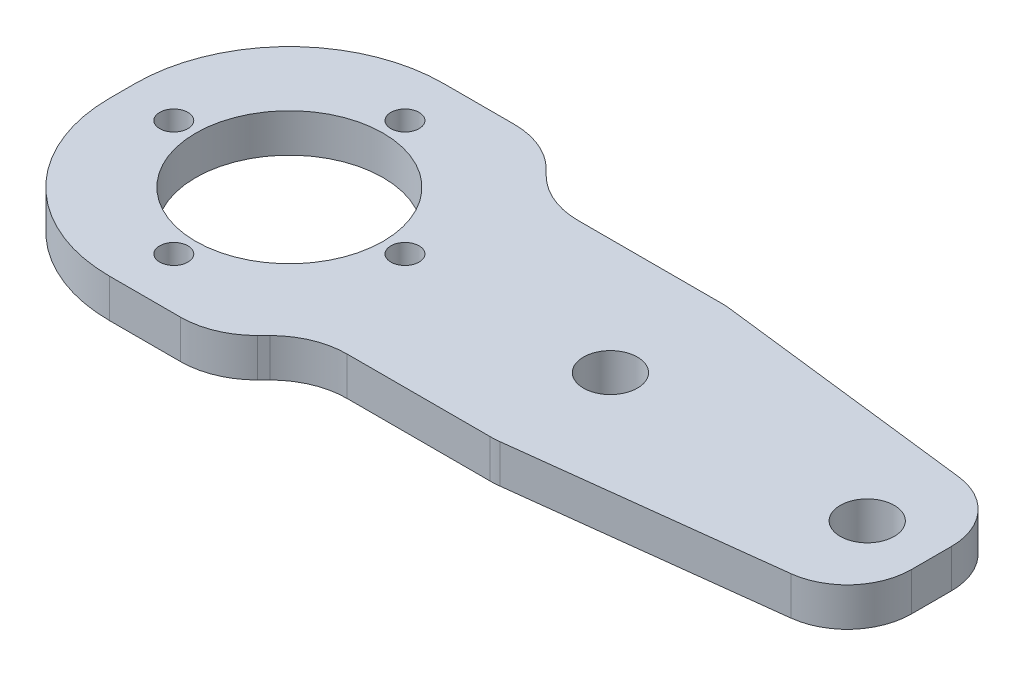
ISO-10303-21;
HEADER;
FILE_DESCRIPTION(('STEP AP214'),'2;1');
FILE_NAME('part.step','',(''),(''),'','','');
FILE_SCHEMA(('AUTOMOTIVE_DESIGN { 1 0 10303 214 1 1 1 1 }'));
ENDSEC;
DATA;
#1=APPLICATION_CONTEXT('core data for automotive mechanical design processes');
#2=APPLICATION_PROTOCOL_DEFINITION('international standard','automotive_design',2000,#1);
#3=PRODUCT_CONTEXT('',#1,'mechanical');
#4=PRODUCT('Part','Part','',(#3));
#5=PRODUCT_RELATED_PRODUCT_CATEGORY('part','',(#4));
#6=PRODUCT_DEFINITION_FORMATION('','',#4);
#7=PRODUCT_DEFINITION_CONTEXT('part definition',#1,'design');
#8=PRODUCT_DEFINITION('design','',#6,#7);
#9=PRODUCT_DEFINITION_SHAPE('','',#8);
#10=(LENGTH_UNIT() NAMED_UNIT(*) SI_UNIT(.MILLI.,.METRE.));
#11=(NAMED_UNIT(*) PLANE_ANGLE_UNIT() SI_UNIT($,.RADIAN.));
#12=(NAMED_UNIT(*) SI_UNIT($,.STERADIAN.) SOLID_ANGLE_UNIT());
#13=UNCERTAINTY_MEASURE_WITH_UNIT(LENGTH_MEASURE(1.E-05),#10,'distance_accuracy_value','');
#14=(GEOMETRIC_REPRESENTATION_CONTEXT(3) GLOBAL_UNCERTAINTY_ASSIGNED_CONTEXT((#13)) GLOBAL_UNIT_ASSIGNED_CONTEXT((#10,
#11,#12)) REPRESENTATION_CONTEXT('',''));
#15=CARTESIAN_POINT('',(0.,0.,0.));
#16=DIRECTION('',(0.,0.,1.));
#17=DIRECTION('',(1.,0.,0.));
#18=AXIS2_PLACEMENT_3D('',#15,#16,#17);
#19=CARTESIAN_POINT('',(0.,3.,0.));
#20=DIRECTION('',(0.,-1.,0.));
#21=DIRECTION('',(0.,0.,-1.));
#22=AXIS2_PLACEMENT_3D('',#19,#20,#21);
#23=PLANE('',#22);
#24=CARTESIAN_POINT('',(22.,3.,-13.));
#25=DIRECTION('',(0.,1.,0.));
#26=DIRECTION('',(0.,0.,1.));
#27=AXIS2_PLACEMENT_3D('',#24,#25,#26);
#28=CIRCLE('',#27,1.1);
#29=CARTESIAN_POINT('',(22.,3.,-11.9));
#30=VERTEX_POINT('',#29);
#31=EDGE_CURVE('E297',#30,#30,#28,.T.);
#32=ORIENTED_EDGE('',*,*,#31,.F.);
#33=EDGE_LOOP('',(#32));
#34=FACE_BOUND('',#33,.T.);
#35=CARTESIAN_POINT('',(13.,3.,-4.));
#36=DIRECTION('',(0.,1.,0.));
#37=DIRECTION('',(0.,0.,1.));
#38=AXIS2_PLACEMENT_3D('',#35,#36,#37);
#39=CIRCLE('',#38,1.1);
#40=CARTESIAN_POINT('',(13.,3.,-2.9));
#41=VERTEX_POINT('',#40);
#42=EDGE_CURVE('E756',#41,#41,#39,.T.);
#43=ORIENTED_EDGE('',*,*,#42,.F.);
#44=EDGE_LOOP('',(#43));
#45=FACE_BOUND('',#44,.T.);
#46=CARTESIAN_POINT('',(4.,3.,-13.0000000000001));
#47=DIRECTION('',(0.,1.,0.));
#48=DIRECTION('',(0.,0.,1.));
#49=AXIS2_PLACEMENT_3D('',#46,#47,#48);
#50=CIRCLE('',#49,1.1);
#51=CARTESIAN_POINT('',(4.,3.,-11.9000000000001));
#52=VERTEX_POINT('',#51);
#53=EDGE_CURVE('E759',#52,#52,#50,.T.);
#54=ORIENTED_EDGE('',*,*,#53,.F.);
#55=EDGE_LOOP('',(#54));
#56=FACE_BOUND('',#55,.T.);
#57=CARTESIAN_POINT('',(13.0000000000001,3.,-22.));
#58=DIRECTION('',(0.,1.,0.));
#59=DIRECTION('',(0.,0.,1.));
#60=AXIS2_PLACEMENT_3D('',#57,#58,#59);
#61=CIRCLE('',#60,1.1);
#62=CARTESIAN_POINT('',(13.0000000000001,3.,-20.9));
#63=VERTEX_POINT('',#62);
#64=EDGE_CURVE('E763',#63,#63,#61,.T.);
#65=ORIENTED_EDGE('',*,*,#64,.F.);
#66=EDGE_LOOP('',(#65));
#67=FACE_BOUND('',#66,.T.);
#68=DIRECTION('',(0.992876838486922,0.,-0.119145220618431));
#69=VECTOR('',#68,1.);
#70=CARTESIAN_POINT('',(38.,3.,-4.));
#71=LINE('',#70,#69);
#72=CARTESIAN_POINT('',(38.3561580756539,3.,-4.04273896907847));
#73=VERTEX_POINT('',#72);
#74=CARTESIAN_POINT('',(58.5957261030921,3.,-6.47148713237106));
#75=VERTEX_POINT('',#74);
#76=EDGE_CURVE('E334',#73,#75,#71,.T.);
#77=ORIENTED_EDGE('',*,*,#76,.T.);
#78=CARTESIAN_POINT('',(58.,3.,-11.4358713248057));
#79=DIRECTION('',(0.,-1.,0.));
#80=DIRECTION('',(0.,0.,-1.));
#81=AXIS2_PLACEMENT_3D('',#78,#79,#80);
#82=CIRCLE('',#81,5.);
#83=CARTESIAN_POINT('',(63.,3.,-11.4358713248057));
#84=VERTEX_POINT('',#83);
#85=EDGE_CURVE('E45',#75,#84,#82,.F.);
#86=ORIENTED_EDGE('',*,*,#85,.T.);
#87=DIRECTION('',(0.,0.,-1.));
#88=VECTOR('',#87,1.);
#89=CARTESIAN_POINT('',(63.,3.,-19.));
#90=LINE('',#89,#88);
#91=CARTESIAN_POINT('',(63.,3.,-14.5641286751943));
#92=VERTEX_POINT('',#91);
#93=EDGE_CURVE('E336',#84,#92,#90,.T.);
#94=ORIENTED_EDGE('',*,*,#93,.T.);
#95=CARTESIAN_POINT('',(58.,3.,-14.5641286751943));
#96=DIRECTION('',(0.,-1.,0.));
#97=DIRECTION('',(0.,0.,-1.));
#98=AXIS2_PLACEMENT_3D('',#95,#96,#97);
#99=CIRCLE('',#98,5.);
#100=CARTESIAN_POINT('',(58.5957261030922,3.,-19.5285128676289));
#101=VERTEX_POINT('',#100);
#102=EDGE_CURVE('E53',#92,#101,#99,.F.);
#103=ORIENTED_EDGE('',*,*,#102,.T.);
#104=DIRECTION('',(-0.992876838486922,0.,-0.11914522061843));
#105=VECTOR('',#104,1.);
#106=CARTESIAN_POINT('',(38.,3.,-22.));
#107=LINE('',#106,#105);
#108=CARTESIAN_POINT('',(38.3561580756539,3.,-21.9572610309215));
#109=VERTEX_POINT('',#108);
#110=EDGE_CURVE('E338',#101,#109,#107,.T.);
#111=ORIENTED_EDGE('',*,*,#110,.T.);
#112=CARTESIAN_POINT('',(37.6412867519433,3.,-16.));
#113=DIRECTION('',(0.,-1.,0.));
#114=DIRECTION('',(0.,0.,-1.));
#115=AXIS2_PLACEMENT_3D('',#112,#113,#114);
#116=CIRCLE('',#115,6.);
#117=CARTESIAN_POINT('',(37.6412867519433,3.,-22.));
#118=VERTEX_POINT('',#117);
#119=EDGE_CURVE('E248',#109,#118,#116,.F.);
#120=ORIENTED_EDGE('',*,*,#119,.T.);
#121=DIRECTION('',(-1.,0.,0.));
#122=VECTOR('',#121,1.);
#123=CARTESIAN_POINT('',(24.,3.,-22.));
#124=LINE('',#123,#122);
#125=CARTESIAN_POINT('',(26.4852813742386,3.,-22.));
#126=VERTEX_POINT('',#125);
#127=EDGE_CURVE('E340',#118,#126,#124,.T.);
#128=ORIENTED_EDGE('',*,*,#127,.T.);
#129=CARTESIAN_POINT('',(26.4852813742386,3.,-28.));
#130=DIRECTION('',(0.,-1.,0.));
#131=DIRECTION('',(0.,0.,-1.));
#132=AXIS2_PLACEMENT_3D('',#129,#130,#131);
#133=CIRCLE('',#132,6.);
#134=CARTESIAN_POINT('',(22.2426406871193,3.,-23.7573593128807));
#135=VERTEX_POINT('',#134);
#136=EDGE_CURVE('E279',#126,#135,#133,.T.);
#137=ORIENTED_EDGE('',*,*,#136,.T.);
#138=DIRECTION('',(-0.707106781186548,0.,-0.707106781186548));
#139=VECTOR('',#138,1.);
#140=CARTESIAN_POINT('',(20.,3.,-26.));
#141=LINE('',#140,#139);
#142=CARTESIAN_POINT('',(21.7573593128807,3.,-24.2426406871193));
#143=VERTEX_POINT('',#142);
#144=EDGE_CURVE('E343',#135,#143,#141,.T.);
#145=ORIENTED_EDGE('',*,*,#144,.T.);
#146=CARTESIAN_POINT('',(17.5147186257614,3.,-20.));
#147=DIRECTION('',(0.,-1.,0.));
#148=DIRECTION('',(0.,0.,-1.));
#149=AXIS2_PLACEMENT_3D('',#146,#147,#148);
#150=CIRCLE('',#149,6.);
#151=CARTESIAN_POINT('',(17.5147186257614,3.,-26.));
#152=VERTEX_POINT('',#151);
#153=EDGE_CURVE('E244',#143,#152,#150,.F.);
#154=ORIENTED_EDGE('',*,*,#153,.T.);
#155=DIRECTION('',(-1.,0.,0.));
#156=VECTOR('',#155,1.);
#157=CARTESIAN_POINT('',(0.,3.,-26.));
#158=LINE('',#157,#156);
#159=CARTESIAN_POINT('',(12.,3.,-26.));
#160=VERTEX_POINT('',#159);
#161=EDGE_CURVE('E346',#152,#160,#158,.T.);
#162=ORIENTED_EDGE('',*,*,#161,.T.);
#163=CARTESIAN_POINT('',(12.,3.,-14.));
#164=DIRECTION('',(0.,-1.,0.));
#165=DIRECTION('',(0.,0.,-1.));
#166=AXIS2_PLACEMENT_3D('',#163,#164,#165);
#167=CIRCLE('',#166,12.);
#168=CARTESIAN_POINT('',(0.,3.,-14.));
#169=VERTEX_POINT('',#168);
#170=EDGE_CURVE('E220',#160,#169,#167,.F.);
#171=ORIENTED_EDGE('',*,*,#170,.T.);
#172=DIRECTION('',(0.,0.,1.));
#173=VECTOR('',#172,1.);
#174=CARTESIAN_POINT('',(0.,3.,0.));
#175=LINE('',#174,#173);
#176=CARTESIAN_POINT('',(0.,3.,-12.));
#177=VERTEX_POINT('',#176);
#178=EDGE_CURVE('E198',#169,#177,#175,.T.);
#179=ORIENTED_EDGE('',*,*,#178,.T.);
#180=CARTESIAN_POINT('',(12.,3.,-12.));
#181=DIRECTION('',(0.,-1.,0.));
#182=DIRECTION('',(0.,0.,-1.));
#183=AXIS2_PLACEMENT_3D('',#180,#181,#182);
#184=CIRCLE('',#183,12.);
#185=CARTESIAN_POINT('',(12.,3.,0.));
#186=VERTEX_POINT('',#185);
#187=EDGE_CURVE('E218',#177,#186,#184,.F.);
#188=ORIENTED_EDGE('',*,*,#187,.T.);
#189=DIRECTION('',(1.,0.,0.));
#190=VECTOR('',#189,1.);
#191=CARTESIAN_POINT('',(0.,3.,0.));
#192=LINE('',#191,#190);
#193=CARTESIAN_POINT('',(17.5147186257614,3.,0.));
#194=VERTEX_POINT('',#193);
#195=EDGE_CURVE('E205',#186,#194,#192,.T.);
#196=ORIENTED_EDGE('',*,*,#195,.T.);
#197=CARTESIAN_POINT('',(17.5147186257614,3.,-6.));
#198=DIRECTION('',(0.,-1.,0.));
#199=DIRECTION('',(0.,0.,-1.));
#200=AXIS2_PLACEMENT_3D('',#197,#198,#199);
#201=CIRCLE('',#200,6.);
#202=CARTESIAN_POINT('',(21.7573593128807,3.,-1.75735931288072));
#203=VERTEX_POINT('',#202);
#204=EDGE_CURVE('E242',#194,#203,#201,.F.);
#205=ORIENTED_EDGE('',*,*,#204,.T.);
#206=DIRECTION('',(0.707106781186548,0.,-0.707106781186548));
#207=VECTOR('',#206,1.);
#208=CARTESIAN_POINT('',(20.,3.,0.));
#209=LINE('',#208,#207);
#210=CARTESIAN_POINT('',(22.2426406871193,3.,-2.24264068711929));
#211=VERTEX_POINT('',#210);
#212=EDGE_CURVE('E209',#203,#211,#209,.T.);
#213=ORIENTED_EDGE('',*,*,#212,.T.);
#214=CARTESIAN_POINT('',(26.4852813742386,3.,2.));
#215=DIRECTION('',(0.,-1.,0.));
#216=DIRECTION('',(0.,0.,-1.));
#217=AXIS2_PLACEMENT_3D('',#214,#215,#216);
#218=CIRCLE('',#217,6.);
#219=CARTESIAN_POINT('',(26.4852813742386,3.,-4.));
#220=VERTEX_POINT('',#219);
#221=EDGE_CURVE('E275',#211,#220,#218,.T.);
#222=ORIENTED_EDGE('',*,*,#221,.T.);
#223=DIRECTION('',(1.,0.,0.));
#224=VECTOR('',#223,1.);
#225=CARTESIAN_POINT('',(24.,3.,-4.));
#226=LINE('',#225,#224);
#227=CARTESIAN_POINT('',(37.6412867519433,3.,-4.));
#228=VERTEX_POINT('',#227);
#229=EDGE_CURVE('E331',#220,#228,#226,.T.);
#230=ORIENTED_EDGE('',*,*,#229,.T.);
#231=CARTESIAN_POINT('',(37.6412867519433,3.,-10.));
#232=DIRECTION('',(0.,-1.,0.));
#233=DIRECTION('',(0.,0.,-1.));
#234=AXIS2_PLACEMENT_3D('',#231,#232,#233);
#235=CIRCLE('',#234,6.);
#236=EDGE_CURVE('E246',#228,#73,#235,.F.);
#237=ORIENTED_EDGE('',*,*,#236,.T.);
#238=EDGE_LOOP('',(#77,#86,#94,#103,#111,#120,#128,#137,#145,#154,#162,#171,#179,#188,#196,#205,
#213,#222,#230,#237));
#239=FACE_BOUND('',#238,.T.);
#240=CARTESIAN_POINT('',(13.,3.,-13.));
#241=DIRECTION('',(0.,1.,0.));
#242=DIRECTION('',(0.,0.,1.));
#243=AXIS2_PLACEMENT_3D('',#240,#241,#242);
#244=CIRCLE('',#243,7.3);
#245=CARTESIAN_POINT('',(13.,3.,-5.7));
#246=VERTEX_POINT('',#245);
#247=EDGE_CURVE('E323',#246,#246,#244,.T.);
#248=ORIENTED_EDGE('',*,*,#247,.F.);
#249=EDGE_LOOP('',(#248));
#250=FACE_BOUND('',#249,.T.);
#251=CARTESIAN_POINT('',(38.,3.,-13.));
#252=DIRECTION('',(0.,1.,0.));
#253=DIRECTION('',(0.,0.,1.));
#254=AXIS2_PLACEMENT_3D('',#251,#252,#253);
#255=CIRCLE('',#254,2.1);
#256=CARTESIAN_POINT('',(38.,3.,-10.9));
#257=VERTEX_POINT('',#256);
#258=EDGE_CURVE('E317',#257,#257,#255,.T.);
#259=ORIENTED_EDGE('',*,*,#258,.F.);
#260=EDGE_LOOP('',(#259));
#261=FACE_BOUND('',#260,.T.);
#262=CARTESIAN_POINT('',(58.,3.,-13.));
#263=DIRECTION('',(0.,1.,0.));
#264=DIRECTION('',(0.,0.,1.));
#265=AXIS2_PLACEMENT_3D('',#262,#263,#264);
#266=CIRCLE('',#265,2.1);
#267=CARTESIAN_POINT('',(58.,3.,-10.9));
#268=VERTEX_POINT('',#267);
#269=EDGE_CURVE('E308',#268,#268,#266,.T.);
#270=ORIENTED_EDGE('',*,*,#269,.F.);
#271=EDGE_LOOP('',(#270));
#272=FACE_BOUND('',#271,.T.);
#273=ADVANCED_FACE('F36',(#34,#45,#56,#67,#239,#250,#261,#272),#23,.F.);
#274=CARTESIAN_POINT('',(0.,0.,0.));
#275=DIRECTION('',(0.,-1.,0.));
#276=DIRECTION('',(0.,0.,-1.));
#277=AXIS2_PLACEMENT_3D('',#274,#275,#276);
#278=PLANE('',#277);
#279=CARTESIAN_POINT('',(22.,0.,-13.));
#280=DIRECTION('',(0.,-1.,0.));
#281=DIRECTION('',(0.,0.,-1.));
#282=AXIS2_PLACEMENT_3D('',#279,#280,#281);
#283=CIRCLE('',#282,1.1);
#284=CARTESIAN_POINT('',(22.,0.,-14.1));
#285=VERTEX_POINT('',#284);
#286=EDGE_CURVE('E40',#285,#285,#283,.T.);
#287=ORIENTED_EDGE('',*,*,#286,.F.);
#288=EDGE_LOOP('',(#287));
#289=FACE_BOUND('',#288,.T.);
#290=CARTESIAN_POINT('',(13.,0.,-4.));
#291=DIRECTION('',(0.,-1.,0.));
#292=DIRECTION('',(0.,0.,-1.));
#293=AXIS2_PLACEMENT_3D('',#290,#291,#292);
#294=CIRCLE('',#293,1.1);
#295=CARTESIAN_POINT('',(13.,0.,-5.1));
#296=VERTEX_POINT('',#295);
#297=EDGE_CURVE('E299',#296,#296,#294,.T.);
#298=ORIENTED_EDGE('',*,*,#297,.F.);
#299=EDGE_LOOP('',(#298));
#300=FACE_BOUND('',#299,.T.);
#301=CARTESIAN_POINT('',(4.,0.,-13.0000000000001));
#302=DIRECTION('',(0.,-1.,0.));
#303=DIRECTION('',(0.,0.,-1.));
#304=AXIS2_PLACEMENT_3D('',#301,#302,#303);
#305=CIRCLE('',#304,1.1);
#306=CARTESIAN_POINT('',(4.,0.,-14.1000000000001));
#307=VERTEX_POINT('',#306);
#308=EDGE_CURVE('E296',#307,#307,#305,.T.);
#309=ORIENTED_EDGE('',*,*,#308,.F.);
#310=EDGE_LOOP('',(#309));
#311=FACE_BOUND('',#310,.T.);
#312=CARTESIAN_POINT('',(13.0000000000001,0.,-22.));
#313=DIRECTION('',(0.,-1.,0.));
#314=DIRECTION('',(0.,0.,-1.));
#315=AXIS2_PLACEMENT_3D('',#312,#313,#314);
#316=CIRCLE('',#315,1.1);
#317=CARTESIAN_POINT('',(13.0000000000001,0.,-23.1));
#318=VERTEX_POINT('',#317);
#319=EDGE_CURVE('E293',#318,#318,#316,.T.);
#320=ORIENTED_EDGE('',*,*,#319,.F.);
#321=EDGE_LOOP('',(#320));
#322=FACE_BOUND('',#321,.T.);
#323=CARTESIAN_POINT('',(38.,0.,-13.));
#324=DIRECTION('',(0.,1.,0.));
#325=DIRECTION('',(0.,0.,1.));
#326=AXIS2_PLACEMENT_3D('',#323,#324,#325);
#327=CIRCLE('',#326,2.1);
#328=CARTESIAN_POINT('',(38.,0.,-10.9));
#329=VERTEX_POINT('',#328);
#330=EDGE_CURVE('E313',#329,#329,#327,.T.);
#331=ORIENTED_EDGE('',*,*,#330,.T.);
#332=EDGE_LOOP('',(#331));
#333=FACE_BOUND('',#332,.T.);
#334=DIRECTION('',(0.,0.,-1.));
#335=VECTOR('',#334,1.);
#336=CARTESIAN_POINT('',(63.,0.,-19.));
#337=LINE('',#336,#335);
#338=CARTESIAN_POINT('',(63.,0.,-11.4358713248057));
#339=VERTEX_POINT('',#338);
#340=CARTESIAN_POINT('',(63.,0.,-14.5641286751943));
#341=VERTEX_POINT('',#340);
#342=EDGE_CURVE('E359',#339,#341,#337,.T.);
#343=ORIENTED_EDGE('',*,*,#342,.F.);
#344=CARTESIAN_POINT('',(58.,0.,-11.4358713248057));
#345=DIRECTION('',(0.,-1.,0.));
#346=DIRECTION('',(0.,0.,-1.));
#347=AXIS2_PLACEMENT_3D('',#344,#345,#346);
#348=CIRCLE('',#347,5.);
#349=CARTESIAN_POINT('',(58.5957261030921,0.,-6.47148713237106));
#350=VERTEX_POINT('',#349);
#351=EDGE_CURVE('E288',#339,#350,#348,.T.);
#352=ORIENTED_EDGE('',*,*,#351,.T.);
#353=DIRECTION('',(0.992876838486922,0.,-0.119145220618431));
#354=VECTOR('',#353,1.);
#355=CARTESIAN_POINT('',(38.,0.,-4.));
#356=LINE('',#355,#354);
#357=CARTESIAN_POINT('',(38.3561580756539,0.,-4.04273896907847));
#358=VERTEX_POINT('',#357);
#359=EDGE_CURVE('E357',#358,#350,#356,.T.);
#360=ORIENTED_EDGE('',*,*,#359,.F.);
#361=CARTESIAN_POINT('',(37.6412867519433,0.,-10.));
#362=DIRECTION('',(0.,-1.,0.));
#363=DIRECTION('',(0.,0.,-1.));
#364=AXIS2_PLACEMENT_3D('',#361,#362,#363);
#365=CIRCLE('',#364,6.);
#366=CARTESIAN_POINT('',(37.6412867519433,0.,-4.));
#367=VERTEX_POINT('',#366);
#368=EDGE_CURVE('E234',#358,#367,#365,.T.);
#369=ORIENTED_EDGE('',*,*,#368,.T.);
#370=DIRECTION('',(1.,0.,0.));
#371=VECTOR('',#370,1.);
#372=CARTESIAN_POINT('',(24.,0.,-4.));
#373=LINE('',#372,#371);
#374=CARTESIAN_POINT('',(26.4852813742386,0.,-4.));
#375=VERTEX_POINT('',#374);
#376=EDGE_CURVE('E354',#375,#367,#373,.T.);
#377=ORIENTED_EDGE('',*,*,#376,.F.);
#378=CARTESIAN_POINT('',(26.4852813742386,0.,2.));
#379=DIRECTION('',(0.,-1.,0.));
#380=DIRECTION('',(0.,0.,-1.));
#381=AXIS2_PLACEMENT_3D('',#378,#379,#380);
#382=CIRCLE('',#381,6.);
#383=CARTESIAN_POINT('',(22.2426406871193,0.,-2.24264068711929));
#384=VERTEX_POINT('',#383);
#385=EDGE_CURVE('E273',#375,#384,#382,.F.);
#386=ORIENTED_EDGE('',*,*,#385,.T.);
#387=DIRECTION('',(0.707106781186548,0.,-0.707106781186548));
#388=VECTOR('',#387,1.);
#389=CARTESIAN_POINT('',(20.,0.,0.));
#390=LINE('',#389,#388);
#391=CARTESIAN_POINT('',(21.7573593128807,0.,-1.75735931288072));
#392=VERTEX_POINT('',#391);
#393=EDGE_CURVE('E351',#392,#384,#390,.T.);
#394=ORIENTED_EDGE('',*,*,#393,.F.);
#395=CARTESIAN_POINT('',(17.5147186257614,0.,-6.));
#396=DIRECTION('',(0.,-1.,0.));
#397=DIRECTION('',(0.,0.,-1.));
#398=AXIS2_PLACEMENT_3D('',#395,#396,#397);
#399=CIRCLE('',#398,6.);
#400=CARTESIAN_POINT('',(17.5147186257614,0.,0.));
#401=VERTEX_POINT('',#400);
#402=EDGE_CURVE('E230',#392,#401,#399,.T.);
#403=ORIENTED_EDGE('',*,*,#402,.T.);
#404=DIRECTION('',(1.,0.,0.));
#405=VECTOR('',#404,1.);
#406=CARTESIAN_POINT('',(0.,0.,0.));
#407=LINE('',#406,#405);
#408=CARTESIAN_POINT('',(12.,0.,0.));
#409=VERTEX_POINT('',#408);
#410=EDGE_CURVE('E326',#409,#401,#407,.T.);
#411=ORIENTED_EDGE('',*,*,#410,.F.);
#412=CARTESIAN_POINT('',(12.,0.,-12.));
#413=DIRECTION('',(0.,-1.,0.));
#414=DIRECTION('',(0.,0.,-1.));
#415=AXIS2_PLACEMENT_3D('',#412,#413,#414);
#416=CIRCLE('',#415,12.);
#417=CARTESIAN_POINT('',(0.,0.,-12.));
#418=VERTEX_POINT('',#417);
#419=EDGE_CURVE('E189',#409,#418,#416,.T.);
#420=ORIENTED_EDGE('',*,*,#419,.T.);
#421=DIRECTION('',(0.,0.,1.));
#422=VECTOR('',#421,1.);
#423=CARTESIAN_POINT('',(0.,0.,0.));
#424=LINE('',#423,#422);
#425=CARTESIAN_POINT('',(0.,0.,-14.));
#426=VERTEX_POINT('',#425);
#427=EDGE_CURVE('E195',#426,#418,#424,.T.);
#428=ORIENTED_EDGE('',*,*,#427,.F.);
#429=CARTESIAN_POINT('',(12.,0.,-14.));
#430=DIRECTION('',(0.,-1.,0.));
#431=DIRECTION('',(0.,0.,-1.));
#432=AXIS2_PLACEMENT_3D('',#429,#430,#431);
#433=CIRCLE('',#432,12.);
#434=CARTESIAN_POINT('',(12.,0.,-26.));
#435=VERTEX_POINT('',#434);
#436=EDGE_CURVE('E179',#426,#435,#433,.T.);
#437=ORIENTED_EDGE('',*,*,#436,.T.);
#438=DIRECTION('',(-1.,0.,0.));
#439=VECTOR('',#438,1.);
#440=CARTESIAN_POINT('',(0.,0.,-26.));
#441=LINE('',#440,#439);
#442=CARTESIAN_POINT('',(17.5147186257614,0.,-26.));
#443=VERTEX_POINT('',#442);
#444=EDGE_CURVE('E206',#443,#435,#441,.T.);
#445=ORIENTED_EDGE('',*,*,#444,.F.);
#446=CARTESIAN_POINT('',(17.5147186257614,0.,-20.));
#447=DIRECTION('',(0.,-1.,0.));
#448=DIRECTION('',(0.,0.,-1.));
#449=AXIS2_PLACEMENT_3D('',#446,#447,#448);
#450=CIRCLE('',#449,6.);
#451=CARTESIAN_POINT('',(21.7573593128807,0.,-24.2426406871193));
#452=VERTEX_POINT('',#451);
#453=EDGE_CURVE('E232',#443,#452,#450,.T.);
#454=ORIENTED_EDGE('',*,*,#453,.T.);
#455=DIRECTION('',(-0.707106781186548,0.,-0.707106781186548));
#456=VECTOR('',#455,1.);
#457=CARTESIAN_POINT('',(20.,0.,-26.));
#458=LINE('',#457,#456);
#459=CARTESIAN_POINT('',(22.2426406871193,0.,-23.7573593128807));
#460=VERTEX_POINT('',#459);
#461=EDGE_CURVE('E211',#460,#452,#458,.T.);
#462=ORIENTED_EDGE('',*,*,#461,.F.);
#463=CARTESIAN_POINT('',(26.4852813742386,0.,-28.));
#464=DIRECTION('',(0.,-1.,0.));
#465=DIRECTION('',(0.,0.,-1.));
#466=AXIS2_PLACEMENT_3D('',#463,#464,#465);
#467=CIRCLE('',#466,6.);
#468=CARTESIAN_POINT('',(26.4852813742386,0.,-22.));
#469=VERTEX_POINT('',#468);
#470=EDGE_CURVE('E277',#460,#469,#467,.F.);
#471=ORIENTED_EDGE('',*,*,#470,.T.);
#472=DIRECTION('',(-1.,0.,0.));
#473=VECTOR('',#472,1.);
#474=CARTESIAN_POINT('',(24.,0.,-22.));
#475=LINE('',#474,#473);
#476=CARTESIAN_POINT('',(37.6412867519433,0.,-22.));
#477=VERTEX_POINT('',#476);
#478=EDGE_CURVE('E364',#477,#469,#475,.T.);
#479=ORIENTED_EDGE('',*,*,#478,.F.);
#480=CARTESIAN_POINT('',(37.6412867519433,0.,-16.));
#481=DIRECTION('',(0.,-1.,0.));
#482=DIRECTION('',(0.,0.,-1.));
#483=AXIS2_PLACEMENT_3D('',#480,#481,#482);
#484=CIRCLE('',#483,6.);
#485=CARTESIAN_POINT('',(38.3561580756539,0.,-21.9572610309215));
#486=VERTEX_POINT('',#485);
#487=EDGE_CURVE('E236',#477,#486,#484,.T.);
#488=ORIENTED_EDGE('',*,*,#487,.T.);
#489=DIRECTION('',(-0.992876838486922,0.,-0.11914522061843));
#490=VECTOR('',#489,1.);
#491=CARTESIAN_POINT('',(38.,0.,-22.));
#492=LINE('',#491,#490);
#493=CARTESIAN_POINT('',(58.5957261030922,0.,-19.5285128676289));
#494=VERTEX_POINT('',#493);
#495=EDGE_CURVE('E362',#494,#486,#492,.T.);
#496=ORIENTED_EDGE('',*,*,#495,.F.);
#497=CARTESIAN_POINT('',(58.,0.,-14.5641286751943));
#498=DIRECTION('',(0.,-1.,0.));
#499=DIRECTION('',(0.,0.,-1.));
#500=AXIS2_PLACEMENT_3D('',#497,#498,#499);
#501=CIRCLE('',#500,5.);
#502=EDGE_CURVE('E286',#494,#341,#501,.T.);
#503=ORIENTED_EDGE('',*,*,#502,.T.);
#504=EDGE_LOOP('',(#343,#352,#360,#369,#377,#386,#394,#403,#411,#420,#428,#437,#445,#454,#462,
#471,#479,#488,#496,#503));
#505=FACE_BOUND('',#504,.T.);
#506=CARTESIAN_POINT('',(13.,0.,-13.));
#507=DIRECTION('',(0.,1.,0.));
#508=DIRECTION('',(0.,0.,1.));
#509=AXIS2_PLACEMENT_3D('',#506,#507,#508);
#510=CIRCLE('',#509,7.3);
#511=CARTESIAN_POINT('',(13.,0.,-5.7));
#512=VERTEX_POINT('',#511);
#513=EDGE_CURVE('E320',#512,#512,#510,.T.);
#514=ORIENTED_EDGE('',*,*,#513,.T.);
#515=EDGE_LOOP('',(#514));
#516=FACE_BOUND('',#515,.T.);
#517=CARTESIAN_POINT('',(58.,0.,-13.));
#518=DIRECTION('',(0.,1.,0.));
#519=DIRECTION('',(0.,0.,1.));
#520=AXIS2_PLACEMENT_3D('',#517,#518,#519);
#521=CIRCLE('',#520,2.1);
#522=CARTESIAN_POINT('',(58.,0.,-10.9));
#523=VERTEX_POINT('',#522);
#524=EDGE_CURVE('E304',#523,#523,#521,.T.);
#525=ORIENTED_EDGE('',*,*,#524,.T.);
#526=EDGE_LOOP('',(#525));
#527=FACE_BOUND('',#526,.T.);
#528=ADVANCED_FACE('F202',(#289,#300,#311,#322,#333,#505,#516,#527),#278,.T.);
#529=CARTESIAN_POINT('',(0.,3.,0.));
#530=DIRECTION('',(0.,0.,-1.));
#531=DIRECTION('',(-1.,0.,0.));
#532=AXIS2_PLACEMENT_3D('',#529,#530,#531);
#533=PLANE('',#532);
#534=ORIENTED_EDGE('',*,*,#410,.T.);
#535=DIRECTION('',(0.,-1.,0.));
#536=VECTOR('',#535,1.);
#537=CARTESIAN_POINT('',(17.5147186257614,3.,0.));
#538=LINE('',#537,#536);
#539=EDGE_CURVE('E271',#401,#194,#538,.F.);
#540=ORIENTED_EDGE('',*,*,#539,.T.);
#541=ORIENTED_EDGE('',*,*,#195,.F.);
#542=DIRECTION('',(0.,-1.,0.));
#543=VECTOR('',#542,1.);
#544=CARTESIAN_POINT('',(12.,3.,0.));
#545=LINE('',#544,#543);
#546=EDGE_CURVE('E222',#186,#409,#545,.T.);
#547=ORIENTED_EDGE('',*,*,#546,.T.);
#548=EDGE_LOOP('',(#534,#540,#541,#547));
#549=FACE_BOUND('',#548,.T.);
#550=ADVANCED_FACE('F387',(#549),#533,.F.);
#551=CARTESIAN_POINT('',(20.,3.,0.));
#552=DIRECTION('',(-0.707106781186547,0.,-0.707106781186547));
#553=DIRECTION('',(-0.707106781186548,0.,0.707106781186548));
#554=AXIS2_PLACEMENT_3D('',#551,#552,#553);
#555=PLANE('',#554);
#556=ORIENTED_EDGE('',*,*,#393,.T.);
#557=DIRECTION('',(0.,-1.,0.));
#558=VECTOR('',#557,1.);
#559=CARTESIAN_POINT('',(22.2426406871193,3.,-2.24264068711928));
#560=LINE('',#559,#558);
#561=EDGE_CURVE('E261',#384,#211,#560,.F.);
#562=ORIENTED_EDGE('',*,*,#561,.T.);
#563=ORIENTED_EDGE('',*,*,#212,.F.);
#564=DIRECTION('',(0.,-1.,0.));
#565=VECTOR('',#564,1.);
#566=CARTESIAN_POINT('',(21.7573593128807,3.,-1.75735931288072));
#567=LINE('',#566,#565);
#568=EDGE_CURVE('E258',#203,#392,#567,.T.);
#569=ORIENTED_EDGE('',*,*,#568,.T.);
#570=EDGE_LOOP('',(#556,#562,#563,#569));
#571=FACE_BOUND('',#570,.T.);
#572=ADVANCED_FACE('F396',(#571),#555,.F.);
#573=CARTESIAN_POINT('',(24.,3.,-4.));
#574=DIRECTION('',(0.,0.,-1.));
#575=DIRECTION('',(-1.,0.,0.));
#576=AXIS2_PLACEMENT_3D('',#573,#574,#575);
#577=PLANE('',#576);
#578=ORIENTED_EDGE('',*,*,#376,.T.);
#579=DIRECTION('',(0.,-1.,0.));
#580=VECTOR('',#579,1.);
#581=CARTESIAN_POINT('',(37.6412867519433,3.,-4.));
#582=LINE('',#581,#580);
#583=EDGE_CURVE('E256',#367,#228,#582,.F.);
#584=ORIENTED_EDGE('',*,*,#583,.T.);
#585=ORIENTED_EDGE('',*,*,#229,.F.);
#586=DIRECTION('',(0.,-1.,0.));
#587=VECTOR('',#586,1.);
#588=CARTESIAN_POINT('',(26.4852813742386,0.,-4.));
#589=LINE('',#588,#587);
#590=EDGE_CURVE('E253',#220,#375,#589,.T.);
#591=ORIENTED_EDGE('',*,*,#590,.T.);
#592=EDGE_LOOP('',(#578,#584,#585,#591));
#593=FACE_BOUND('',#592,.T.);
#594=ADVANCED_FACE('F405',(#593),#577,.F.);
#595=CARTESIAN_POINT('',(38.,3.,-4.));
#596=DIRECTION('',(-0.119145220618431,0.,-0.992876838486922));
#597=DIRECTION('',(-0.992876838486922,0.,0.119145220618431));
#598=AXIS2_PLACEMENT_3D('',#595,#596,#597);
#599=PLANE('',#598);
#600=ORIENTED_EDGE('',*,*,#359,.T.);
#601=DIRECTION('',(0.,-1.,0.));
#602=VECTOR('',#601,1.);
#603=CARTESIAN_POINT('',(58.5957261030922,3.,-6.47148713237106));
#604=LINE('',#603,#602);
#605=EDGE_CURVE('E61',#350,#75,#604,.F.);
#606=ORIENTED_EDGE('',*,*,#605,.T.);
#607=ORIENTED_EDGE('',*,*,#76,.F.);
#608=DIRECTION('',(0.,-1.,0.));
#609=VECTOR('',#608,1.);
#610=CARTESIAN_POINT('',(38.3561580756539,3.,-4.04273896907847));
#611=LINE('',#610,#609);
#612=EDGE_CURVE('E250',#73,#358,#611,.T.);
#613=ORIENTED_EDGE('',*,*,#612,.T.);
#614=EDGE_LOOP('',(#600,#606,#607,#613));
#615=FACE_BOUND('',#614,.T.);
#616=ADVANCED_FACE('F412',(#615),#599,.F.);
#617=CARTESIAN_POINT('',(63.,3.,-19.));
#618=DIRECTION('',(-1.,0.,0.));
#619=DIRECTION('',(0.,0.,1.));
#620=AXIS2_PLACEMENT_3D('',#617,#618,#619);
#621=PLANE('',#620);
#622=ORIENTED_EDGE('',*,*,#93,.F.);
#623=DIRECTION('',(0.,-1.,0.));
#624=VECTOR('',#623,1.);
#625=CARTESIAN_POINT('',(63.,3.,-11.4358713248057));
#626=LINE('',#625,#624);
#627=EDGE_CURVE('E283',#84,#339,#626,.T.);
#628=ORIENTED_EDGE('',*,*,#627,.T.);
#629=ORIENTED_EDGE('',*,*,#342,.T.);
#630=DIRECTION('',(0.,-1.,0.));
#631=VECTOR('',#630,1.);
#632=CARTESIAN_POINT('',(63.,3.,-14.5641286751943));
#633=LINE('',#632,#631);
#634=EDGE_CURVE('E281',#341,#92,#633,.F.);
#635=ORIENTED_EDGE('',*,*,#634,.T.);
#636=EDGE_LOOP('',(#622,#628,#629,#635));
#637=FACE_BOUND('',#636,.T.);
#638=ADVANCED_FACE('F419',(#637),#621,.F.);
#639=CARTESIAN_POINT('',(38.,3.,-22.));
#640=DIRECTION('',(-0.11914522061843,0.,0.992876838486922));
#641=DIRECTION('',(0.992876838486922,0.,0.11914522061843));
#642=AXIS2_PLACEMENT_3D('',#639,#640,#641);
#643=PLANE('',#642);
#644=ORIENTED_EDGE('',*,*,#110,.F.);
#645=DIRECTION('',(0.,-1.,0.));
#646=VECTOR('',#645,1.);
#647=CARTESIAN_POINT('',(58.5957261030922,3.,-19.5285128676289));
#648=LINE('',#647,#646);
#649=EDGE_CURVE('E11',#101,#494,#648,.T.);
#650=ORIENTED_EDGE('',*,*,#649,.T.);
#651=ORIENTED_EDGE('',*,*,#495,.T.);
#652=DIRECTION('',(0.,-1.,0.));
#653=VECTOR('',#652,1.);
#654=CARTESIAN_POINT('',(38.3561580756539,3.,-21.9572610309215));
#655=LINE('',#654,#653);
#656=EDGE_CURVE('E239',#486,#109,#655,.F.);
#657=ORIENTED_EDGE('',*,*,#656,.T.);
#658=EDGE_LOOP('',(#644,#650,#651,#657));
#659=FACE_BOUND('',#658,.T.);
#660=ADVANCED_FACE('F425',(#659),#643,.F.);
#661=CARTESIAN_POINT('',(24.,3.,-22.));
#662=DIRECTION('',(0.,0.,1.));
#663=DIRECTION('',(1.,0.,0.));
#664=AXIS2_PLACEMENT_3D('',#661,#662,#663);
#665=PLANE('',#664);
#666=ORIENTED_EDGE('',*,*,#127,.F.);
#667=DIRECTION('',(0.,-1.,0.));
#668=VECTOR('',#667,1.);
#669=CARTESIAN_POINT('',(37.6412867519433,3.,-22.));
#670=LINE('',#669,#668);
#671=EDGE_CURVE('E227',#118,#477,#670,.T.);
#672=ORIENTED_EDGE('',*,*,#671,.T.);
#673=ORIENTED_EDGE('',*,*,#478,.T.);
#674=DIRECTION('',(0.,-1.,0.));
#675=VECTOR('',#674,1.);
#676=CARTESIAN_POINT('',(26.4852813742386,3.,-22.));
#677=LINE('',#676,#675);
#678=EDGE_CURVE('E225',#469,#126,#677,.F.);
#679=ORIENTED_EDGE('',*,*,#678,.T.);
#680=EDGE_LOOP('',(#666,#672,#673,#679));
#681=FACE_BOUND('',#680,.T.);
#682=ADVANCED_FACE('F433',(#681),#665,.F.);
#683=CARTESIAN_POINT('',(20.,3.,-26.));
#684=DIRECTION('',(-0.707106781186547,0.,0.707106781186547));
#685=DIRECTION('',(0.707106781186548,0.,0.707106781186548));
#686=AXIS2_PLACEMENT_3D('',#683,#684,#685);
#687=PLANE('',#686);
#688=ORIENTED_EDGE('',*,*,#144,.F.);
#689=DIRECTION('',(0.,-1.,0.));
#690=VECTOR('',#689,1.);
#691=CARTESIAN_POINT('',(22.2426406871193,0.,-23.7573593128807));
#692=LINE('',#691,#690);
#693=EDGE_CURVE('E265',#135,#460,#692,.T.);
#694=ORIENTED_EDGE('',*,*,#693,.T.);
#695=ORIENTED_EDGE('',*,*,#461,.T.);
#696=DIRECTION('',(0.,-1.,0.));
#697=VECTOR('',#696,1.);
#698=CARTESIAN_POINT('',(21.7573593128807,3.,-24.2426406871193));
#699=LINE('',#698,#697);
#700=EDGE_CURVE('E263',#452,#143,#699,.F.);
#701=ORIENTED_EDGE('',*,*,#700,.T.);
#702=EDGE_LOOP('',(#688,#694,#695,#701));
#703=FACE_BOUND('',#702,.T.);
#704=ADVANCED_FACE('F371',(#703),#687,.F.);
#705=CARTESIAN_POINT('',(0.,3.,-26.));
#706=DIRECTION('',(0.,0.,1.));
#707=DIRECTION('',(1.,0.,0.));
#708=AXIS2_PLACEMENT_3D('',#705,#706,#707);
#709=PLANE('',#708);
#710=ORIENTED_EDGE('',*,*,#161,.F.);
#711=DIRECTION('',(0.,-1.,0.));
#712=VECTOR('',#711,1.);
#713=CARTESIAN_POINT('',(17.5147186257614,3.,-26.));
#714=LINE('',#713,#712);
#715=EDGE_CURVE('E268',#152,#443,#714,.T.);
#716=ORIENTED_EDGE('',*,*,#715,.T.);
#717=ORIENTED_EDGE('',*,*,#444,.T.);
#718=DIRECTION('',(0.,-1.,0.));
#719=VECTOR('',#718,1.);
#720=CARTESIAN_POINT('',(12.,3.,-26.));
#721=LINE('',#720,#719);
#722=EDGE_CURVE('E185',#435,#160,#721,.F.);
#723=ORIENTED_EDGE('',*,*,#722,.T.);
#724=EDGE_LOOP('',(#710,#716,#717,#723));
#725=FACE_BOUND('',#724,.T.);
#726=ADVANCED_FACE('F380',(#725),#709,.F.);
#727=CARTESIAN_POINT('',(0.,3.,0.));
#728=DIRECTION('',(1.,0.,0.));
#729=DIRECTION('',(0.,0.,-1.));
#730=AXIS2_PLACEMENT_3D('',#727,#728,#729);
#731=PLANE('',#730);
#732=ORIENTED_EDGE('',*,*,#178,.F.);
#733=DIRECTION('',(0.,-1.,0.));
#734=VECTOR('',#733,1.);
#735=CARTESIAN_POINT('',(0.,3.,-14.));
#736=LINE('',#735,#734);
#737=EDGE_CURVE('E183',#169,#426,#736,.T.);
#738=ORIENTED_EDGE('',*,*,#737,.T.);
#739=ORIENTED_EDGE('',*,*,#427,.T.);
#740=DIRECTION('',(0.,-1.,0.));
#741=VECTOR('',#740,1.);
#742=CARTESIAN_POINT('',(0.,3.,-12.));
#743=LINE('',#742,#741);
#744=EDGE_CURVE('E199',#418,#177,#743,.F.);
#745=ORIENTED_EDGE('',*,*,#744,.T.);
#746=EDGE_LOOP('',(#732,#738,#739,#745));
#747=FACE_BOUND('',#746,.T.);
#748=ADVANCED_FACE('F194',(#747),#731,.F.);
#749=CARTESIAN_POINT('',(13.,3.,-13.));
#750=DIRECTION('',(0.,-1.,0.));
#751=DIRECTION('',(0.,0.,-1.));
#752=AXIS2_PLACEMENT_3D('',#749,#750,#751);
#753=CYLINDRICAL_SURFACE('',#752,7.3);
#754=ORIENTED_EDGE('',*,*,#247,.T.);
#755=EDGE_LOOP('',(#754));
#756=FACE_BOUND('',#755,.T.);
#757=ORIENTED_EDGE('',*,*,#513,.F.);
#758=EDGE_LOOP('',(#757));
#759=FACE_BOUND('',#758,.T.);
#760=ADVANCED_FACE('F458',(#756,#759),#753,.F.);
#761=CARTESIAN_POINT('',(38.,3.,-13.));
#762=DIRECTION('',(0.,-1.,0.));
#763=DIRECTION('',(0.,0.,-1.));
#764=AXIS2_PLACEMENT_3D('',#761,#762,#763);
#765=CYLINDRICAL_SURFACE('',#764,2.1);
#766=ORIENTED_EDGE('',*,*,#258,.T.);
#767=EDGE_LOOP('',(#766));
#768=FACE_BOUND('',#767,.T.);
#769=ORIENTED_EDGE('',*,*,#330,.F.);
#770=EDGE_LOOP('',(#769));
#771=FACE_BOUND('',#770,.T.);
#772=ADVANCED_FACE('F653',(#768,#771),#765,.F.);
#773=CARTESIAN_POINT('',(58.,3.,-13.));
#774=DIRECTION('',(0.,-1.,0.));
#775=DIRECTION('',(0.,0.,-1.));
#776=AXIS2_PLACEMENT_3D('',#773,#774,#775);
#777=CYLINDRICAL_SURFACE('',#776,2.1);
#778=ORIENTED_EDGE('',*,*,#269,.T.);
#779=EDGE_LOOP('',(#778));
#780=FACE_BOUND('',#779,.T.);
#781=ORIENTED_EDGE('',*,*,#524,.F.);
#782=EDGE_LOOP('',(#781));
#783=FACE_BOUND('',#782,.T.);
#784=ADVANCED_FACE('F483',(#780,#783),#777,.F.);
#785=CARTESIAN_POINT('',(12.,3.,-14.));
#786=DIRECTION('',(0.,-1.,0.));
#787=DIRECTION('',(0.,0.,-1.));
#788=AXIS2_PLACEMENT_3D('',#785,#786,#787);
#789=CYLINDRICAL_SURFACE('',#788,12.);
#790=ORIENTED_EDGE('',*,*,#170,.F.);
#791=ORIENTED_EDGE('',*,*,#722,.F.);
#792=ORIENTED_EDGE('',*,*,#436,.F.);
#793=ORIENTED_EDGE('',*,*,#737,.F.);
#794=EDGE_LOOP('',(#790,#791,#792,#793));
#795=FACE_BOUND('',#794,.T.);
#796=ADVANCED_FACE('F182',(#795),#789,.T.);
#797=CARTESIAN_POINT('',(12.,3.,-12.));
#798=DIRECTION('',(0.,-1.,0.));
#799=DIRECTION('',(0.,0.,-1.));
#800=AXIS2_PLACEMENT_3D('',#797,#798,#799);
#801=CYLINDRICAL_SURFACE('',#800,12.);
#802=ORIENTED_EDGE('',*,*,#187,.F.);
#803=ORIENTED_EDGE('',*,*,#744,.F.);
#804=ORIENTED_EDGE('',*,*,#419,.F.);
#805=ORIENTED_EDGE('',*,*,#546,.F.);
#806=EDGE_LOOP('',(#802,#803,#804,#805));
#807=FACE_BOUND('',#806,.T.);
#808=ADVANCED_FACE('F385',(#807),#801,.T.);
#809=CARTESIAN_POINT('',(37.6412867519433,3.,-16.));
#810=DIRECTION('',(0.,-1.,0.));
#811=DIRECTION('',(0.,0.,-1.));
#812=AXIS2_PLACEMENT_3D('',#809,#810,#811);
#813=CYLINDRICAL_SURFACE('',#812,6.);
#814=ORIENTED_EDGE('',*,*,#119,.F.);
#815=ORIENTED_EDGE('',*,*,#656,.F.);
#816=ORIENTED_EDGE('',*,*,#487,.F.);
#817=ORIENTED_EDGE('',*,*,#671,.F.);
#818=EDGE_LOOP('',(#814,#815,#816,#817));
#819=FACE_BOUND('',#818,.T.);
#820=ADVANCED_FACE('F436',(#819),#813,.T.);
#821=CARTESIAN_POINT('',(37.6412867519433,3.,-10.));
#822=DIRECTION('',(0.,-1.,0.));
#823=DIRECTION('',(0.,0.,-1.));
#824=AXIS2_PLACEMENT_3D('',#821,#822,#823);
#825=CYLINDRICAL_SURFACE('',#824,6.);
#826=ORIENTED_EDGE('',*,*,#236,.F.);
#827=ORIENTED_EDGE('',*,*,#583,.F.);
#828=ORIENTED_EDGE('',*,*,#368,.F.);
#829=ORIENTED_EDGE('',*,*,#612,.F.);
#830=EDGE_LOOP('',(#826,#827,#828,#829));
#831=FACE_BOUND('',#830,.T.);
#832=ADVANCED_FACE('F411',(#831),#825,.T.);
#833=CARTESIAN_POINT('',(26.4852813742386,3.,2.));
#834=DIRECTION('',(0.,1.,0.));
#835=DIRECTION('',(0.,0.,1.));
#836=AXIS2_PLACEMENT_3D('',#833,#834,#835);
#837=CYLINDRICAL_SURFACE('',#836,6.);
#838=ORIENTED_EDGE('',*,*,#221,.F.);
#839=ORIENTED_EDGE('',*,*,#561,.F.);
#840=ORIENTED_EDGE('',*,*,#385,.F.);
#841=ORIENTED_EDGE('',*,*,#590,.F.);
#842=EDGE_LOOP('',(#838,#839,#840,#841));
#843=FACE_BOUND('',#842,.T.);
#844=ADVANCED_FACE('F402',(#843),#837,.F.);
#845=CARTESIAN_POINT('',(26.4852813742386,3.,-28.));
#846=DIRECTION('',(0.,1.,0.));
#847=DIRECTION('',(0.,0.,1.));
#848=AXIS2_PLACEMENT_3D('',#845,#846,#847);
#849=CYLINDRICAL_SURFACE('',#848,6.);
#850=ORIENTED_EDGE('',*,*,#136,.F.);
#851=ORIENTED_EDGE('',*,*,#678,.F.);
#852=ORIENTED_EDGE('',*,*,#470,.F.);
#853=ORIENTED_EDGE('',*,*,#693,.F.);
#854=EDGE_LOOP('',(#850,#851,#852,#853));
#855=FACE_BOUND('',#854,.T.);
#856=ADVANCED_FACE('F438',(#855),#849,.F.);
#857=CARTESIAN_POINT('',(17.5147186257614,3.,-20.));
#858=DIRECTION('',(0.,-1.,0.));
#859=DIRECTION('',(0.,0.,-1.));
#860=AXIS2_PLACEMENT_3D('',#857,#858,#859);
#861=CYLINDRICAL_SURFACE('',#860,6.);
#862=ORIENTED_EDGE('',*,*,#153,.F.);
#863=ORIENTED_EDGE('',*,*,#700,.F.);
#864=ORIENTED_EDGE('',*,*,#453,.F.);
#865=ORIENTED_EDGE('',*,*,#715,.F.);
#866=EDGE_LOOP('',(#862,#863,#864,#865));
#867=FACE_BOUND('',#866,.T.);
#868=ADVANCED_FACE('F375',(#867),#861,.T.);
#869=CARTESIAN_POINT('',(17.5147186257614,3.,-6.));
#870=DIRECTION('',(0.,-1.,0.));
#871=DIRECTION('',(0.,0.,-1.));
#872=AXIS2_PLACEMENT_3D('',#869,#870,#871);
#873=CYLINDRICAL_SURFACE('',#872,6.);
#874=ORIENTED_EDGE('',*,*,#204,.F.);
#875=ORIENTED_EDGE('',*,*,#539,.F.);
#876=ORIENTED_EDGE('',*,*,#402,.F.);
#877=ORIENTED_EDGE('',*,*,#568,.F.);
#878=EDGE_LOOP('',(#874,#875,#876,#877));
#879=FACE_BOUND('',#878,.T.);
#880=ADVANCED_FACE('F393',(#879),#873,.T.);
#881=CARTESIAN_POINT('',(58.,3.,-11.4358713248057));
#882=DIRECTION('',(0.,-1.,0.));
#883=DIRECTION('',(0.,0.,-1.));
#884=AXIS2_PLACEMENT_3D('',#881,#882,#883);
#885=CYLINDRICAL_SURFACE('',#884,5.);
#886=ORIENTED_EDGE('',*,*,#85,.F.);
#887=ORIENTED_EDGE('',*,*,#605,.F.);
#888=ORIENTED_EDGE('',*,*,#351,.F.);
#889=ORIENTED_EDGE('',*,*,#627,.F.);
#890=EDGE_LOOP('',(#886,#887,#888,#889));
#891=FACE_BOUND('',#890,.T.);
#892=ADVANCED_FACE('F417',(#891),#885,.T.);
#893=CARTESIAN_POINT('',(58.,3.,-14.5641286751943));
#894=DIRECTION('',(0.,-1.,0.));
#895=DIRECTION('',(0.,0.,-1.));
#896=AXIS2_PLACEMENT_3D('',#893,#894,#895);
#897=CYLINDRICAL_SURFACE('',#896,5.);
#898=ORIENTED_EDGE('',*,*,#102,.F.);
#899=ORIENTED_EDGE('',*,*,#634,.F.);
#900=ORIENTED_EDGE('',*,*,#502,.F.);
#901=ORIENTED_EDGE('',*,*,#649,.F.);
#902=EDGE_LOOP('',(#898,#899,#900,#901));
#903=FACE_BOUND('',#902,.T.);
#904=ADVANCED_FACE('F38',(#903),#897,.T.);
#905=CARTESIAN_POINT('',(13.0000000000001,-7.,-22.));
#906=DIRECTION('',(0.,1.,0.));
#907=DIRECTION('',(0.,0.,1.));
#908=AXIS2_PLACEMENT_3D('',#905,#906,#907);
#909=CYLINDRICAL_SURFACE('',#908,1.1);
#910=ORIENTED_EDGE('',*,*,#319,.T.);
#911=EDGE_LOOP('',(#910));
#912=FACE_BOUND('',#911,.T.);
#913=ORIENTED_EDGE('',*,*,#64,.T.);
#914=EDGE_LOOP('',(#913));
#915=FACE_BOUND('',#914,.T.);
#916=ADVANCED_FACE('F558',(#912,#915),#909,.F.);
#917=CARTESIAN_POINT('',(4.,-7.,-13.0000000000001));
#918=DIRECTION('',(0.,1.,0.));
#919=DIRECTION('',(0.,0.,1.));
#920=AXIS2_PLACEMENT_3D('',#917,#918,#919);
#921=CYLINDRICAL_SURFACE('',#920,1.1);
#922=ORIENTED_EDGE('',*,*,#308,.T.);
#923=EDGE_LOOP('',(#922));
#924=FACE_BOUND('',#923,.T.);
#925=ORIENTED_EDGE('',*,*,#53,.T.);
#926=EDGE_LOOP('',(#925));
#927=FACE_BOUND('',#926,.T.);
#928=ADVANCED_FACE('F581',(#924,#927),#921,.F.);
#929=CARTESIAN_POINT('',(13.,-7.,-4.));
#930=DIRECTION('',(0.,1.,0.));
#931=DIRECTION('',(0.,0.,1.));
#932=AXIS2_PLACEMENT_3D('',#929,#930,#931);
#933=CYLINDRICAL_SURFACE('',#932,1.1);
#934=ORIENTED_EDGE('',*,*,#297,.T.);
#935=EDGE_LOOP('',(#934));
#936=FACE_BOUND('',#935,.T.);
#937=ORIENTED_EDGE('',*,*,#42,.T.);
#938=EDGE_LOOP('',(#937));
#939=FACE_BOUND('',#938,.T.);
#940=ADVANCED_FACE('F592',(#936,#939),#933,.F.);
#941=CARTESIAN_POINT('',(22.,-7.,-13.));
#942=DIRECTION('',(0.,1.,0.));
#943=DIRECTION('',(0.,0.,1.));
#944=AXIS2_PLACEMENT_3D('',#941,#942,#943);
#945=CYLINDRICAL_SURFACE('',#944,1.1);
#946=ORIENTED_EDGE('',*,*,#286,.T.);
#947=EDGE_LOOP('',(#946));
#948=FACE_BOUND('',#947,.T.);
#949=ORIENTED_EDGE('',*,*,#31,.T.);
#950=EDGE_LOOP('',(#949));
#951=FACE_BOUND('',#950,.T.);
#952=ADVANCED_FACE('F603',(#948,#951),#945,.F.);
#953=CLOSED_SHELL('',(#273,#528,#550,#572,#594,#616,#638,#660,#682,#704,#726,#748,#760,#772,
#784,#796,#808,#820,#832,#844,#856,#868,#880,#892,#904,#916,#928,#940,#952));
#954=MANIFOLD_SOLID_BREP('B2',#953);
#955=ADVANCED_BREP_SHAPE_REPRESENTATION('',(#18,#954),#14);
#956=SHAPE_DEFINITION_REPRESENTATION(#9,#955);
ENDSEC;
END-ISO-10303-21;
